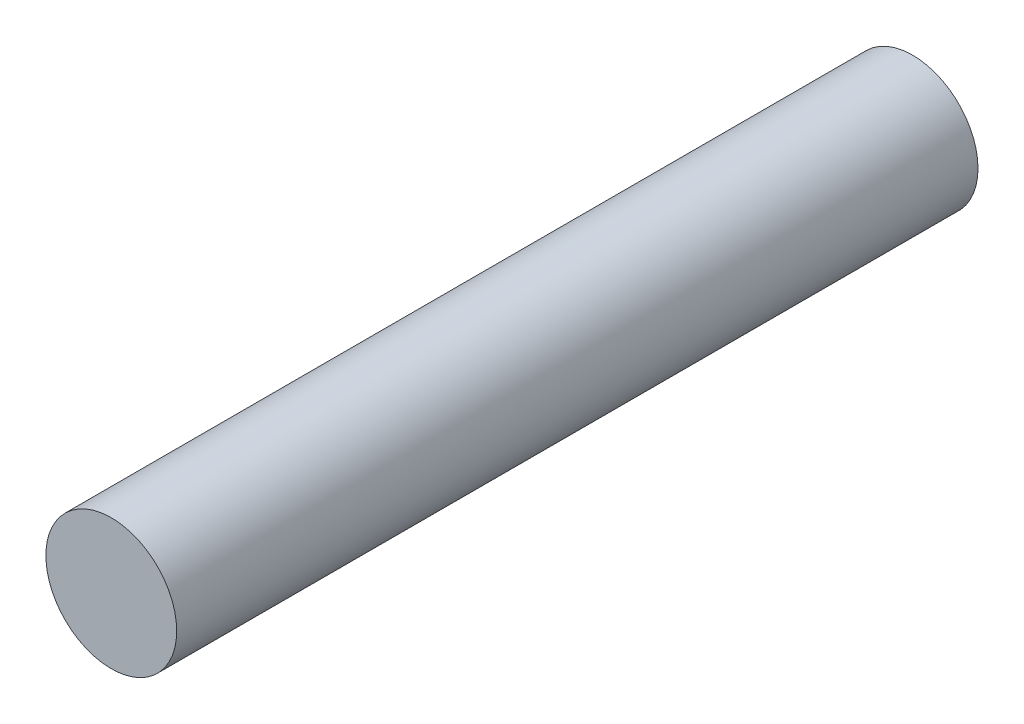
ISO-10303-21;
HEADER;
FILE_DESCRIPTION(('STEP AP214'),'2;1');
FILE_NAME('part.step','',(''),(''),'','','');
FILE_SCHEMA(('AUTOMOTIVE_DESIGN { 1 0 10303 214 1 1 1 1 }'));
ENDSEC;
DATA;
#1=APPLICATION_CONTEXT('core data for automotive mechanical design processes');
#2=APPLICATION_PROTOCOL_DEFINITION('international standard','automotive_design',2000,#1);
#3=PRODUCT_CONTEXT('',#1,'mechanical');
#4=PRODUCT('Part','Part','',(#3));
#5=PRODUCT_RELATED_PRODUCT_CATEGORY('part','',(#4));
#6=PRODUCT_DEFINITION_FORMATION('','',#4);
#7=PRODUCT_DEFINITION_CONTEXT('part definition',#1,'design');
#8=PRODUCT_DEFINITION('design','',#6,#7);
#9=PRODUCT_DEFINITION_SHAPE('','',#8);
#10=(LENGTH_UNIT() NAMED_UNIT(*) SI_UNIT(.MILLI.,.METRE.));
#11=(NAMED_UNIT(*) PLANE_ANGLE_UNIT() SI_UNIT($,.RADIAN.));
#12=(NAMED_UNIT(*) SI_UNIT($,.STERADIAN.) SOLID_ANGLE_UNIT());
#13=UNCERTAINTY_MEASURE_WITH_UNIT(LENGTH_MEASURE(1.E-05),#10,'distance_accuracy_value','');
#14=(GEOMETRIC_REPRESENTATION_CONTEXT(3) GLOBAL_UNCERTAINTY_ASSIGNED_CONTEXT((#13)) GLOBAL_UNIT_ASSIGNED_CONTEXT((#10,
#11,#12)) REPRESENTATION_CONTEXT('',''));
#15=CARTESIAN_POINT('',(0.,0.,0.));
#16=DIRECTION('',(0.,0.,1.));
#17=DIRECTION('',(1.,0.,0.));
#18=AXIS2_PLACEMENT_3D('',#15,#16,#17);
#19=CARTESIAN_POINT('',(0.,0.,49.));
#20=DIRECTION('',(0.,0.,-1.));
#21=DIRECTION('',(-1.,0.,0.));
#22=AXIS2_PLACEMENT_3D('',#19,#20,#21);
#23=CYLINDRICAL_SURFACE('',#22,4.);
#24=CARTESIAN_POINT('',(0.,0.,49.));
#25=DIRECTION('',(0.,0.,1.));
#26=DIRECTION('',(1.,0.,0.));
#27=AXIS2_PLACEMENT_3D('',#24,#25,#26);
#28=CIRCLE('',#27,4.);
#29=CARTESIAN_POINT('',(4.,0.,49.));
#30=VERTEX_POINT('',#29);
#31=EDGE_CURVE('E10',#30,#30,#28,.T.);
#32=ORIENTED_EDGE('',*,*,#31,.F.);
#33=EDGE_LOOP('',(#32));
#34=FACE_BOUND('',#33,.T.);
#35=CARTESIAN_POINT('',(0.,0.,0.));
#36=DIRECTION('',(0.,0.,1.));
#37=DIRECTION('',(1.,0.,0.));
#38=AXIS2_PLACEMENT_3D('',#35,#36,#37);
#39=CIRCLE('',#38,4.);
#40=CARTESIAN_POINT('',(4.,0.,0.));
#41=VERTEX_POINT('',#40);
#42=EDGE_CURVE('E36',#41,#41,#39,.T.);
#43=ORIENTED_EDGE('',*,*,#42,.T.);
#44=EDGE_LOOP('',(#43));
#45=FACE_BOUND('',#44,.T.);
#46=ADVANCED_FACE('F33',(#34,#45),#23,.T.);
#47=CARTESIAN_POINT('',(0.,0.,49.));
#48=DIRECTION('',(0.,0.,1.));
#49=DIRECTION('',(1.,0.,0.));
#50=AXIS2_PLACEMENT_3D('',#47,#48,#49);
#51=PLANE('',#50);
#52=ORIENTED_EDGE('',*,*,#31,.T.);
#53=EDGE_LOOP('',(#52));
#54=FACE_BOUND('',#53,.T.);
#55=ADVANCED_FACE('F48',(#54),#51,.T.);
#56=CARTESIAN_POINT('',(0.,0.,0.));
#57=DIRECTION('',(0.,0.,1.));
#58=DIRECTION('',(1.,0.,0.));
#59=AXIS2_PLACEMENT_3D('',#56,#57,#58);
#60=PLANE('',#59);
#61=ORIENTED_EDGE('',*,*,#42,.F.);
#62=EDGE_LOOP('',(#61));
#63=FACE_BOUND('',#62,.T.);
#64=ADVANCED_FACE('F46',(#63),#60,.F.);
#65=CLOSED_SHELL('',(#46,#55,#64));
#66=MANIFOLD_SOLID_BREP('B2',#65);
#67=ADVANCED_BREP_SHAPE_REPRESENTATION('',(#18,#66),#14);
#68=SHAPE_DEFINITION_REPRESENTATION(#9,#67);
ENDSEC;
END-ISO-10303-21;
